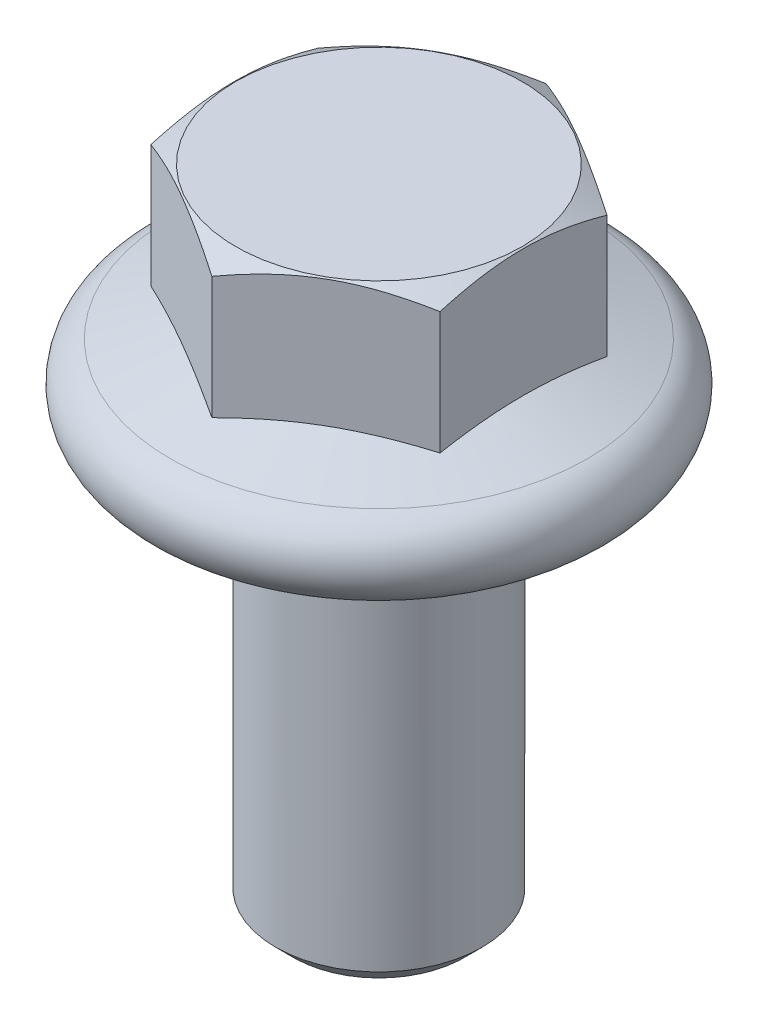
ISO-10303-21;
HEADER;
FILE_DESCRIPTION(('STEP AP214'),'2;1');
FILE_NAME('part.step','',(''),(''),'','','');
FILE_SCHEMA(('AUTOMOTIVE_DESIGN { 1 0 10303 214 1 1 1 1 }'));
ENDSEC;
DATA;
#1=APPLICATION_CONTEXT('core data for automotive mechanical design processes');
#2=APPLICATION_PROTOCOL_DEFINITION('international standard','automotive_design',2000,#1);
#3=PRODUCT_CONTEXT('',#1,'mechanical');
#4=PRODUCT('Part','Part','',(#3));
#5=PRODUCT_RELATED_PRODUCT_CATEGORY('part','',(#4));
#6=PRODUCT_DEFINITION_FORMATION('','',#4);
#7=PRODUCT_DEFINITION_CONTEXT('part definition',#1,'design');
#8=PRODUCT_DEFINITION('design','',#6,#7);
#9=PRODUCT_DEFINITION_SHAPE('','',#8);
#10=(LENGTH_UNIT() NAMED_UNIT(*) SI_UNIT(.MILLI.,.METRE.));
#11=(NAMED_UNIT(*) PLANE_ANGLE_UNIT() SI_UNIT($,.RADIAN.));
#12=(NAMED_UNIT(*) SI_UNIT($,.STERADIAN.) SOLID_ANGLE_UNIT());
#13=UNCERTAINTY_MEASURE_WITH_UNIT(LENGTH_MEASURE(1.E-05),#10,'distance_accuracy_value','');
#14=(GEOMETRIC_REPRESENTATION_CONTEXT(3) GLOBAL_UNCERTAINTY_ASSIGNED_CONTEXT((#13)) GLOBAL_UNIT_ASSIGNED_CONTEXT((#10,
#11,#12)) REPRESENTATION_CONTEXT('',''));
#15=CARTESIAN_POINT('',(0.,0.,0.));
#16=DIRECTION('',(0.,0.,1.));
#17=DIRECTION('',(1.,0.,0.));
#18=AXIS2_PLACEMENT_3D('',#15,#16,#17);
#19=CARTESIAN_POINT('',(240.373014836143,302.855724271466,22.6340957400018));
#20=DIRECTION('',(-0.5,0.,0.866025403784439));
#21=DIRECTION('',(-0.866025403784439,0.,-0.5));
#22=AXIS2_PLACEMENT_3D('',#19,#20,#21);
#23=PLANE('',#22);
#24=CARTESIAN_POINT('',(242.123014836143,301.859593955879,23.6444587110837));
#25=CARTESIAN_POINT('',(241.978072119349,301.890061991369,23.5607759945255));
#26=CARTESIAN_POINT('',(241.832651473807,301.917777838993,23.4768173456761));
#27=CARTESIAN_POINT('',(241.540864732313,301.966539457553,23.3083541919284));
#28=CARTESIAN_POINT('',(241.394497987511,301.987580010171,23.2238493124171));
#29=CARTESIAN_POINT('',(241.102443223051,302.021612455459,23.0552314155375));
#30=CARTESIAN_POINT('',(240.95676187187,302.034678571179,22.9711222482173));
#31=CARTESIAN_POINT('',(240.66505852699,302.052203892642,22.8027072435273));
#32=CARTESIAN_POINT('',(240.519036681566,302.056666325061,22.7184014917646));
#33=CARTESIAN_POINT('',(240.22699299072,302.056666325061,22.5497899882391));
#34=CARTESIAN_POINT('',(240.080971145296,302.052203892642,22.4654842364763));
#35=CARTESIAN_POINT('',(239.789267800416,302.034678571179,22.2970692317863));
#36=CARTESIAN_POINT('',(239.643586449235,302.021612455459,22.2129600644661));
#37=CARTESIAN_POINT('',(239.351531684774,301.987580010171,22.0443421675865));
#38=CARTESIAN_POINT('',(239.205164939973,301.966539457553,21.9598372880752));
#39=CARTESIAN_POINT('',(238.913378198479,301.917777838993,21.7913741343275));
#40=CARTESIAN_POINT('',(238.767957552937,301.890061991369,21.7074154854781));
#41=CARTESIAN_POINT('',(238.623014836143,301.859593955879,21.62373276892));
#42=B_SPLINE_CURVE_WITH_KNOTS('',3,(#24,#25,#26,#27,#28,#29,#30,#31,#32,#33,#34,#35,#36,#37,#38,
#39,#40,#41),.UNSPECIFIED.,.F.,.F.,(4,2,2,2,2,2,2,2,4),(0.,0.510400948319148,1.02119991788172,
1.52716902069207,2.03294833077719,2.53872764086231,3.04469674367264,3.55549571323521,
4.06589666155436),.UNSPECIFIED.);
#43=CARTESIAN_POINT('',(242.123014836143,301.859593955879,23.6444587110837));
#44=VERTEX_POINT('',#43);
#45=CARTESIAN_POINT('',(238.623014836143,301.859593955879,21.62373276892));
#46=VERTEX_POINT('',#45);
#47=EDGE_CURVE('E41',#44,#46,#42,.T.);
#48=ORIENTED_EDGE('',*,*,#47,.F.);
#49=DIRECTION('',(0.,1.,0.));
#50=VECTOR('',#49,1.);
#51=CARTESIAN_POINT('',(242.123014836143,300.555724271466,23.6444587110837));
#52=LINE('',#51,#50);
#53=CARTESIAN_POINT('',(242.123014836143,304.822909620874,23.6444587110837));
#54=VERTEX_POINT('',#53);
#55=EDGE_CURVE('E11',#44,#54,#52,.T.);
#56=ORIENTED_EDGE('',*,*,#55,.T.);
#57=CARTESIAN_POINT('',(242.123014836143,304.822909620874,23.6444587110836));
#58=CARTESIAN_POINT('',(241.969211032908,304.874192416903,23.5556600438833));
#59=CARTESIAN_POINT('',(241.814079597431,304.920831435949,23.466094867851));
#60=CARTESIAN_POINT('',(241.501130729442,305.002238442924,23.2854137546753));
#61=CARTESIAN_POINT('',(241.343307738245,305.036977635283,23.1942946082231));
#62=CARTESIAN_POINT('',(241.029617577065,305.091051692719,23.0131855092237));
#63=CARTESIAN_POINT('',(240.873798658814,305.11074649258,22.9232234148268));
#64=CARTESIAN_POINT('',(240.561428025334,305.134253576646,22.7428761455004));
#65=CARTESIAN_POINT('',(240.404877444709,305.13808533142,22.6524916256343));
#66=CARTESIAN_POINT('',(240.112379479151,305.130093613104,22.4836178464821));
#67=CARTESIAN_POINT('',(239.976388202516,305.120232371746,22.4051032463097));
#68=CARTESIAN_POINT('',(239.705291588055,305.088984344618,22.2485855429739));
#69=CARTESIAN_POINT('',(239.570187187179,305.06758689503,22.1705829807595));
#70=CARTESIAN_POINT('',(239.298532088125,305.014097412533,22.0137428361941));
#71=CARTESIAN_POINT('',(239.162015754222,304.981778746993,21.9349250940662));
#72=CARTESIAN_POINT('',(238.891018638634,304.908429039406,21.7784648364323));
#73=CARTESIAN_POINT('',(238.756534387842,304.867415220558,21.7008203180356));
#74=CARTESIAN_POINT('',(238.623014836143,304.822909620875,21.62373276892));
#75=B_SPLINE_CURVE_WITH_KNOTS('',3,(#57,#58,#59,#60,#61,#62,#63,#64,#65,#66,#67,#68,#69,#70,#71,
#72,#73,#74),.UNSPECIFIED.,.F.,.F.,(4,2,2,2,2,2,2,2,4),(0.,0.554778020224514,1.11088917979749,
1.65323831076767,2.19492155557127,2.66648861960586,3.13849233914022,3.62096283935513,
4.10248645365111),.UNSPECIFIED.);
#76=CARTESIAN_POINT('',(238.623014836143,304.822909620874,21.62373276892));
#77=VERTEX_POINT('',#76);
#78=EDGE_CURVE('E33',#54,#77,#75,.T.);
#79=ORIENTED_EDGE('',*,*,#78,.T.);
#80=DIRECTION('',(0.,1.,0.));
#81=VECTOR('',#80,1.);
#82=CARTESIAN_POINT('',(238.623014836143,300.555724271466,21.62373276892));
#83=LINE('',#82,#81);
#84=EDGE_CURVE('E148',#46,#77,#83,.T.);
#85=ORIENTED_EDGE('',*,*,#84,.F.);
#86=EDGE_LOOP('',(#48,#56,#79,#85));
#87=FACE_BOUND('',#86,.T.);
#88=ADVANCED_FACE('F17',(#87),#23,.T.);
#89=CARTESIAN_POINT('',(238.623014836143,302.855724271466,19.6030068267563));
#90=DIRECTION('',(-1.,0.,0.));
#91=DIRECTION('',(0.,0.,-1.));
#92=AXIS2_PLACEMENT_3D('',#89,#90,#91);
#93=PLANE('',#92);
#94=CARTESIAN_POINT('',(238.623014836143,301.859593955879,21.6237327689199));
#95=CARTESIAN_POINT('',(238.623014836143,301.890061991369,21.4563673358036));
#96=CARTESIAN_POINT('',(238.623014836143,301.917777838993,21.2884500381049));
#97=CARTESIAN_POINT('',(238.623014836143,301.966539457553,20.9515237306094));
#98=CARTESIAN_POINT('',(238.623014836143,301.987580010171,20.7825139715868));
#99=CARTESIAN_POINT('',(238.623014836143,302.021612455459,20.4452781778276));
#100=CARTESIAN_POINT('',(238.623014836143,302.034678571179,20.2770598431872));
#101=CARTESIAN_POINT('',(238.623014836143,302.052203892642,19.9402298338073));
#102=CARTESIAN_POINT('',(238.623014836143,302.056666325061,19.7716183302818));
#103=CARTESIAN_POINT('',(238.623014836143,302.056666325061,19.4343953232308));
#104=CARTESIAN_POINT('',(238.623014836143,302.052203892642,19.2657838197053));
#105=CARTESIAN_POINT('',(238.623014836143,302.034678571179,18.9289538103254));
#106=CARTESIAN_POINT('',(238.623014836143,302.021612455459,18.760735475685));
#107=CARTESIAN_POINT('',(238.623014836143,301.987580010171,18.4234996819258));
#108=CARTESIAN_POINT('',(238.623014836143,301.966539457553,18.2544899229032));
#109=CARTESIAN_POINT('',(238.623014836143,301.917777838993,17.9175636154077));
#110=CARTESIAN_POINT('',(238.623014836143,301.890061991369,17.749646317709));
#111=CARTESIAN_POINT('',(238.623014836143,301.859593955879,17.5822808845926));
#112=B_SPLINE_CURVE_WITH_KNOTS('',3,(#94,#95,#96,#97,#98,#99,#100,#101,#102,#103,#104,#105,#106,
#107,#108,#109,#110,#111),.UNSPECIFIED.,.F.,.F.,(4,2,2,2,2,2,2,2,4),(0.,0.51040094831915,
1.02119991788171,1.52716902069203,2.03294833077715,2.53872764086227,3.04469674367259,
3.55549571323515,4.0658966615543),.UNSPECIFIED.);
#113=CARTESIAN_POINT('',(238.623014836143,301.859593955879,17.5822808845926));
#114=VERTEX_POINT('',#113);
#115=EDGE_CURVE('E255',#46,#114,#112,.T.);
#116=ORIENTED_EDGE('',*,*,#115,.F.);
#117=ORIENTED_EDGE('',*,*,#84,.T.);
#118=CARTESIAN_POINT('',(238.623014836143,304.822909620874,21.6237327689202));
#119=CARTESIAN_POINT('',(238.623014836143,304.874192416903,21.4461354345196));
#120=CARTESIAN_POINT('',(238.623014836143,304.920831435949,21.267005082455));
#121=CARTESIAN_POINT('',(238.623014836143,305.002238442924,20.9056428561034));
#122=CARTESIAN_POINT('',(238.623014836143,305.036977635283,20.7234045631991));
#123=CARTESIAN_POINT('',(238.623014836143,305.091051692719,20.3611863652003));
#124=CARTESIAN_POINT('',(238.623014836143,305.11074649258,20.1812621764065));
#125=CARTESIAN_POINT('',(238.623014836143,305.134253576646,19.8205676377536));
#126=CARTESIAN_POINT('',(238.623014836143,305.13808533142,19.6397985980215));
#127=CARTESIAN_POINT('',(238.623014836143,305.130093613104,19.3020510397171));
#128=CARTESIAN_POINT('',(238.623014836143,305.120232371746,19.1450218393722));
#129=CARTESIAN_POINT('',(238.623014836143,305.088984344618,18.8319864327006));
#130=CARTESIAN_POINT('',(238.623014836143,305.06758689503,18.6759813082717));
#131=CARTESIAN_POINT('',(238.623014836143,305.014097412533,18.3623010191409));
#132=CARTESIAN_POINT('',(238.623014836143,304.981778746993,18.2046655348852));
#133=CARTESIAN_POINT('',(238.623014836143,304.908429039406,17.8917450196172));
#134=CARTESIAN_POINT('',(238.623014836143,304.867415220558,17.7364559828239));
#135=CARTESIAN_POINT('',(238.623014836143,304.822909620874,17.5822808845927));
#136=B_SPLINE_CURVE_WITH_KNOTS('',3,(#118,#119,#120,#121,#122,#123,#124,#125,#126,#127,#128,
#129,#130,#131,#132,#133,#134,#135),.UNSPECIFIED.,.F.,.F.,(4,2,2,2,2,2,2,2,4),(0.,
0.554778020224538,1.11088917979755,1.65323831076773,2.1949215555713,2.66648861960593,
3.13849233914035,3.62096283935536,4.1024864536514),.UNSPECIFIED.);
#137=CARTESIAN_POINT('',(238.623014836143,304.822909620874,17.5822808845926));
#138=VERTEX_POINT('',#137);
#139=EDGE_CURVE('E150',#77,#138,#136,.T.);
#140=ORIENTED_EDGE('',*,*,#139,.T.);
#141=DIRECTION('',(0.,1.,0.));
#142=VECTOR('',#141,1.);
#143=CARTESIAN_POINT('',(238.623014836143,300.555724271466,17.5822808845926));
#144=LINE('',#143,#142);
#145=EDGE_CURVE('E159',#114,#138,#144,.T.);
#146=ORIENTED_EDGE('',*,*,#145,.F.);
#147=EDGE_LOOP('',(#116,#117,#140,#146));
#148=FACE_BOUND('',#147,.T.);
#149=ADVANCED_FACE('F260',(#148),#93,.T.);
#150=CARTESIAN_POINT('',(240.373014836143,302.855724271466,16.5719179135108));
#151=DIRECTION('',(-0.5,0.,-0.866025403784439));
#152=DIRECTION('',(0.866025403784439,0.,-0.5));
#153=AXIS2_PLACEMENT_3D('',#150,#151,#152);
#154=PLANE('',#153);
#155=CARTESIAN_POINT('',(238.623014836143,301.859593955879,17.5822808845926));
#156=CARTESIAN_POINT('',(238.767957552937,301.890061991369,17.4985981680345));
#157=CARTESIAN_POINT('',(238.913378198479,301.917777838993,17.4146395191851));
#158=CARTESIAN_POINT('',(239.205164939973,301.966539457553,17.2461763654374));
#159=CARTESIAN_POINT('',(239.351531684774,301.987580010171,17.1616714859261));
#160=CARTESIAN_POINT('',(239.643586449235,302.021612455459,16.9930535890465));
#161=CARTESIAN_POINT('',(239.789267800416,302.034678571179,16.9089444217263));
#162=CARTESIAN_POINT('',(240.080971145296,302.052203892642,16.7405294170363));
#163=CARTESIAN_POINT('',(240.22699299072,302.056666325061,16.6562236652736));
#164=CARTESIAN_POINT('',(240.519036681566,302.056666325061,16.487612161748));
#165=CARTESIAN_POINT('',(240.66505852699,302.052203892642,16.4033064099853));
#166=CARTESIAN_POINT('',(240.95676187187,302.034678571179,16.2348914052953));
#167=CARTESIAN_POINT('',(241.102443223051,302.021612455459,16.1507822379751));
#168=CARTESIAN_POINT('',(241.394497987511,301.987580010171,15.9821643410955));
#169=CARTESIAN_POINT('',(241.540864732313,301.966539457553,15.8976594615842));
#170=CARTESIAN_POINT('',(241.832651473807,301.917777838993,15.7291963078365));
#171=CARTESIAN_POINT('',(241.978072119349,301.890061991369,15.6452376589871));
#172=CARTESIAN_POINT('',(242.123014836143,301.859593955879,15.5615549424289));
#173=B_SPLINE_CURVE_WITH_KNOTS('',3,(#155,#156,#157,#158,#159,#160,#161,#162,#163,#164,#165,
#166,#167,#168,#169,#170,#171,#172),.UNSPECIFIED.,.F.,.F.,(4,2,2,2,2,2,2,2,4),(0.,
0.510400948319151,1.02119991788172,1.52716902069205,2.03294833077717,2.53872764086229,
3.04469674367264,3.55549571323521,4.06589666155436),.UNSPECIFIED.);
#174=CARTESIAN_POINT('',(242.123014836143,301.859593955879,15.5615549424289));
#175=VERTEX_POINT('',#174);
#176=EDGE_CURVE('E228',#114,#175,#173,.T.);
#177=ORIENTED_EDGE('',*,*,#176,.F.);
#178=ORIENTED_EDGE('',*,*,#145,.T.);
#179=CARTESIAN_POINT('',(238.623014836143,304.822909620874,17.5822808845926));
#180=CARTESIAN_POINT('',(238.776818639378,304.874192416903,17.4934822173923));
#181=CARTESIAN_POINT('',(238.931950074855,304.920831435949,17.40391704136));
#182=CARTESIAN_POINT('',(239.244898942844,305.002238442924,17.2232359281843));
#183=CARTESIAN_POINT('',(239.402721934041,305.036977635283,17.1321167817321));
#184=CARTESIAN_POINT('',(239.716412095221,305.091051692719,16.9510076827327));
#185=CARTESIAN_POINT('',(239.872231013472,305.11074649258,16.8610455883358));
#186=CARTESIAN_POINT('',(240.184601646952,305.134253576646,16.6806983190094));
#187=CARTESIAN_POINT('',(240.341152227577,305.13808533142,16.5903137991433));
#188=CARTESIAN_POINT('',(240.633650193135,305.130093613104,16.4214400199911));
#189=CARTESIAN_POINT('',(240.76964146977,305.120232371746,16.3429254198186));
#190=CARTESIAN_POINT('',(241.040738084231,305.088984344618,16.1864077164829));
#191=CARTESIAN_POINT('',(241.175842485107,305.06758689503,16.1084051542684));
#192=CARTESIAN_POINT('',(241.447497584161,305.014097412533,15.951565009703));
#193=CARTESIAN_POINT('',(241.584013918064,304.981778746993,15.8727472675752));
#194=CARTESIAN_POINT('',(241.855011033652,304.908429039406,15.7162870099412));
#195=CARTESIAN_POINT('',(241.989495284444,304.867415220558,15.6386424915446));
#196=CARTESIAN_POINT('',(242.123014836143,304.822909620874,15.561554942429));
#197=B_SPLINE_CURVE_WITH_KNOTS('',3,(#179,#180,#181,#182,#183,#184,#185,#186,#187,#188,#189,
#190,#191,#192,#193,#194,#195,#196),.UNSPECIFIED.,.F.,.F.,(4,2,2,2,2,2,2,2,4),(0.,
0.554778020224544,1.11088917979755,1.65323831076773,2.19492155557129,2.66648861960589,
3.13849233914025,3.62096283935524,4.10248645365126),.UNSPECIFIED.);
#198=CARTESIAN_POINT('',(242.123014836143,304.822909620874,15.5615549424289));
#199=VERTEX_POINT('',#198);
#200=EDGE_CURVE('E158',#138,#199,#197,.T.);
#201=ORIENTED_EDGE('',*,*,#200,.T.);
#202=DIRECTION('',(0.,1.,0.));
#203=VECTOR('',#202,1.);
#204=CARTESIAN_POINT('',(242.123014836143,300.555724271466,15.5615549424289));
#205=LINE('',#204,#203);
#206=EDGE_CURVE('E156',#175,#199,#205,.T.);
#207=ORIENTED_EDGE('',*,*,#206,.F.);
#208=EDGE_LOOP('',(#177,#178,#201,#207));
#209=FACE_BOUND('',#208,.T.);
#210=ADVANCED_FACE('F219',(#209),#154,.T.);
#211=CARTESIAN_POINT('',(243.873014836143,302.855724271466,16.5719179135108));
#212=DIRECTION('',(0.5,0.,-0.866025403784439));
#213=DIRECTION('',(0.866025403784439,0.,0.5));
#214=AXIS2_PLACEMENT_3D('',#211,#212,#213);
#215=PLANE('',#214);
#216=CARTESIAN_POINT('',(242.123014836143,301.859593955879,15.5615549424289));
#217=CARTESIAN_POINT('',(242.267957552937,301.890061991369,15.6452376589871));
#218=CARTESIAN_POINT('',(242.413378198479,301.917777838993,15.7291963078365));
#219=CARTESIAN_POINT('',(242.705164939973,301.966539457553,15.8976594615842));
#220=CARTESIAN_POINT('',(242.851531684774,301.987580010171,15.9821643410955));
#221=CARTESIAN_POINT('',(243.143586449235,302.021612455459,16.1507822379751));
#222=CARTESIAN_POINT('',(243.289267800416,302.034678571179,16.2348914052953));
#223=CARTESIAN_POINT('',(243.580971145296,302.052203892642,16.4033064099853));
#224=CARTESIAN_POINT('',(243.72699299072,302.056666325061,16.487612161748));
#225=CARTESIAN_POINT('',(244.019036681566,302.056666325061,16.6562236652736));
#226=CARTESIAN_POINT('',(244.16505852699,302.052203892642,16.7405294170363));
#227=CARTESIAN_POINT('',(244.45676187187,302.034678571179,16.9089444217263));
#228=CARTESIAN_POINT('',(244.602443223051,302.021612455459,16.9930535890465));
#229=CARTESIAN_POINT('',(244.894497987511,301.987580010171,17.1616714859261));
#230=CARTESIAN_POINT('',(245.040864732313,301.966539457553,17.2461763654374));
#231=CARTESIAN_POINT('',(245.332651473807,301.917777838993,17.4146395191851));
#232=CARTESIAN_POINT('',(245.478072119349,301.890061991369,17.4985981680345));
#233=CARTESIAN_POINT('',(245.623014836143,301.859593955879,17.5822808845926));
#234=B_SPLINE_CURVE_WITH_KNOTS('',3,(#216,#217,#218,#219,#220,#221,#222,#223,#224,#225,#226,
#227,#228,#229,#230,#231,#232,#233),.UNSPECIFIED.,.F.,.F.,(4,2,2,2,2,2,2,2,4),(0.,
0.510400948319148,1.02119991788172,1.52716902069207,2.03294833077719,2.53872764086231,
3.04469674367264,3.55549571323521,4.06589666155436),.UNSPECIFIED.);
#235=CARTESIAN_POINT('',(245.623014836143,301.859593955879,17.5822808845926));
#236=VERTEX_POINT('',#235);
#237=EDGE_CURVE('E64',#175,#236,#234,.T.);
#238=ORIENTED_EDGE('',*,*,#237,.F.);
#239=ORIENTED_EDGE('',*,*,#206,.T.);
#240=CARTESIAN_POINT('',(242.123014836143,304.822909620874,15.561554942429));
#241=CARTESIAN_POINT('',(242.276818639378,304.874192416903,15.6503536096293));
#242=CARTESIAN_POINT('',(242.431950074855,304.920831435949,15.7399187856616));
#243=CARTESIAN_POINT('',(242.744898942844,305.002238442924,15.9205998988373));
#244=CARTESIAN_POINT('',(242.902721934041,305.036977635283,16.0117190452895));
#245=CARTESIAN_POINT('',(243.216412095221,305.091051692719,16.1928281442889));
#246=CARTESIAN_POINT('',(243.372231013472,305.11074649258,16.2827902386858));
#247=CARTESIAN_POINT('',(243.684601646952,305.134253576646,16.4631375080122));
#248=CARTESIAN_POINT('',(243.841152227577,305.13808533142,16.5535220278783));
#249=CARTESIAN_POINT('',(244.133650193135,305.130093613104,16.7223958070305));
#250=CARTESIAN_POINT('',(244.26964146977,305.120232371746,16.800910407203));
#251=CARTESIAN_POINT('',(244.540738084231,305.088984344618,16.9574281105387));
#252=CARTESIAN_POINT('',(244.675842485107,305.06758689503,17.0354306727532));
#253=CARTESIAN_POINT('',(244.947497584161,305.014097412533,17.1922708173186));
#254=CARTESIAN_POINT('',(245.084013918064,304.981778746993,17.2710885594464));
#255=CARTESIAN_POINT('',(245.355011033652,304.908429039406,17.4275488170804));
#256=CARTESIAN_POINT('',(245.489495284444,304.867415220558,17.505193335477));
#257=CARTESIAN_POINT('',(245.623014836143,304.822909620874,17.5822808845926));
#258=B_SPLINE_CURVE_WITH_KNOTS('',3,(#240,#241,#242,#243,#244,#245,#246,#247,#248,#249,#250,
#251,#252,#253,#254,#255,#256,#257),.UNSPECIFIED.,.F.,.F.,(4,2,2,2,2,2,2,2,4),(0.,
0.554778020224515,1.11088917979755,1.65323831076773,2.19492155557129,2.66648861960589,
3.13849233914025,3.62096283935524,4.10248645365126),.UNSPECIFIED.);
#259=CARTESIAN_POINT('',(245.623014836143,304.822909620874,17.5822808845926));
#260=VERTEX_POINT('',#259);
#261=EDGE_CURVE('E155',#199,#260,#258,.T.);
#262=ORIENTED_EDGE('',*,*,#261,.T.);
#263=DIRECTION('',(0.,1.,0.));
#264=VECTOR('',#263,1.);
#265=CARTESIAN_POINT('',(245.623014836143,300.555724271466,17.5822808845926));
#266=LINE('',#265,#264);
#267=EDGE_CURVE('E153',#236,#260,#266,.T.);
#268=ORIENTED_EDGE('',*,*,#267,.F.);
#269=EDGE_LOOP('',(#238,#239,#262,#268));
#270=FACE_BOUND('',#269,.T.);
#271=ADVANCED_FACE('F214',(#270),#215,.T.);
#272=CARTESIAN_POINT('',(245.623014836143,302.855724271466,19.6030068267563));
#273=DIRECTION('',(1.,0.,0.));
#274=DIRECTION('',(0.,0.,1.));
#275=AXIS2_PLACEMENT_3D('',#272,#273,#274);
#276=PLANE('',#275);
#277=CARTESIAN_POINT('',(245.623014836143,301.859593955879,17.5822808845926));
#278=CARTESIAN_POINT('',(245.623014836143,301.890061991369,17.749646317709));
#279=CARTESIAN_POINT('',(245.623014836143,301.917777838993,17.9175636154077));
#280=CARTESIAN_POINT('',(245.623014836143,301.966539457553,18.2544899229032));
#281=CARTESIAN_POINT('',(245.623014836143,301.987580010171,18.4234996819258));
#282=CARTESIAN_POINT('',(245.623014836143,302.021612455459,18.760735475685));
#283=CARTESIAN_POINT('',(245.623014836143,302.034678571179,18.9289538103254));
#284=CARTESIAN_POINT('',(245.623014836143,302.052203892642,19.2657838197053));
#285=CARTESIAN_POINT('',(245.623014836143,302.056666325061,19.4343953232308));
#286=CARTESIAN_POINT('',(245.623014836143,302.056666325061,19.7716183302818));
#287=CARTESIAN_POINT('',(245.623014836143,302.052203892642,19.9402298338073));
#288=CARTESIAN_POINT('',(245.623014836143,302.034678571179,20.2770598431872));
#289=CARTESIAN_POINT('',(245.623014836143,302.021612455459,20.4452781778276));
#290=CARTESIAN_POINT('',(245.623014836143,301.987580010171,20.7825139715868));
#291=CARTESIAN_POINT('',(245.623014836143,301.966539457553,20.9515237306094));
#292=CARTESIAN_POINT('',(245.623014836143,301.917777838993,21.2884500381049));
#293=CARTESIAN_POINT('',(245.623014836143,301.890061991369,21.4563673358036));
#294=CARTESIAN_POINT('',(245.623014836143,301.859593955879,21.6237327689199));
#295=B_SPLINE_CURVE_WITH_KNOTS('',3,(#277,#278,#279,#280,#281,#282,#283,#284,#285,#286,#287,
#288,#289,#290,#291,#292,#293,#294),.UNSPECIFIED.,.F.,.F.,(4,2,2,2,2,2,2,2,4),(0.,
0.51040094831915,1.02119991788171,1.52716902069203,2.03294833077715,2.53872764086227,
3.04469674367259,3.55549571323515,4.0658966615543),.UNSPECIFIED.);
#296=CARTESIAN_POINT('',(245.623014836143,301.859593955879,21.62373276892));
#297=VERTEX_POINT('',#296);
#298=EDGE_CURVE('E21',#236,#297,#295,.T.);
#299=ORIENTED_EDGE('',*,*,#298,.F.);
#300=ORIENTED_EDGE('',*,*,#267,.T.);
#301=CARTESIAN_POINT('',(245.623014836143,304.822909620874,17.5822808845927));
#302=CARTESIAN_POINT('',(245.623014836143,304.874192416903,17.7598782189933));
#303=CARTESIAN_POINT('',(245.623014836143,304.920831435949,17.9390085710579));
#304=CARTESIAN_POINT('',(245.623014836143,305.002238442924,18.3003707974094));
#305=CARTESIAN_POINT('',(245.623014836143,305.036977635283,18.4826090903138));
#306=CARTESIAN_POINT('',(245.623014836143,305.091051692719,18.8448272883125));
#307=CARTESIAN_POINT('',(245.623014836143,305.11074649258,19.0247514771063));
#308=CARTESIAN_POINT('',(245.623014836143,305.134253576647,19.3854460157592));
#309=CARTESIAN_POINT('',(245.623014836143,305.13808533142,19.5662150554913));
#310=CARTESIAN_POINT('',(245.623014836143,305.130093613104,19.9039626137957));
#311=CARTESIAN_POINT('',(245.623014836143,305.120232371746,20.0609918141406));
#312=CARTESIAN_POINT('',(245.623014836143,305.088984344618,20.3740272208121));
#313=CARTESIAN_POINT('',(245.623014836143,305.06758689503,20.530032345241));
#314=CARTESIAN_POINT('',(245.623014836143,305.014097412533,20.8437126343718));
#315=CARTESIAN_POINT('',(245.623014836143,304.981778746993,21.0013481186275));
#316=CARTESIAN_POINT('',(245.623014836143,304.908429039406,21.3142686338954));
#317=CARTESIAN_POINT('',(245.623014836143,304.867415220558,21.4695576706887));
#318=CARTESIAN_POINT('',(245.623014836143,304.822909620874,21.6237327689199));
#319=B_SPLINE_CURVE_WITH_KNOTS('',3,(#301,#302,#303,#304,#305,#306,#307,#308,#309,#310,#311,
#312,#313,#314,#315,#316,#317,#318),.UNSPECIFIED.,.F.,.F.,(4,2,2,2,2,2,2,2,4),(0.,
0.554778020224512,1.1108891797975,1.65323831076766,2.19492155557121,2.66648861960579,
3.13849233914015,3.62096283935512,4.10248645365111),.UNSPECIFIED.);
#320=CARTESIAN_POINT('',(245.623014836143,304.822909620874,21.6237327689199));
#321=VERTEX_POINT('',#320);
#322=EDGE_CURVE('E152',#260,#321,#319,.T.);
#323=ORIENTED_EDGE('',*,*,#322,.T.);
#324=DIRECTION('',(0.,1.,0.));
#325=VECTOR('',#324,1.);
#326=CARTESIAN_POINT('',(245.623014836143,300.555724271466,21.62373276892));
#327=LINE('',#326,#325);
#328=EDGE_CURVE('E73',#297,#321,#327,.T.);
#329=ORIENTED_EDGE('',*,*,#328,.F.);
#330=EDGE_LOOP('',(#299,#300,#323,#329));
#331=FACE_BOUND('',#330,.T.);
#332=ADVANCED_FACE('F211',(#331),#276,.T.);
#333=CARTESIAN_POINT('',(243.873014836143,302.855724271466,22.6340957400018));
#334=DIRECTION('',(0.5,0.,0.866025403784439));
#335=DIRECTION('',(-0.866025403784439,0.,0.5));
#336=AXIS2_PLACEMENT_3D('',#333,#334,#335);
#337=PLANE('',#336);
#338=CARTESIAN_POINT('',(245.623014836143,301.859593955879,21.62373276892));
#339=CARTESIAN_POINT('',(245.478072119349,301.890061991369,21.7074154854781));
#340=CARTESIAN_POINT('',(245.332651473807,301.917777838993,21.7913741343275));
#341=CARTESIAN_POINT('',(245.040864732313,301.966539457553,21.9598372880752));
#342=CARTESIAN_POINT('',(244.894497987511,301.987580010171,22.0443421675865));
#343=CARTESIAN_POINT('',(244.602443223051,302.021612455459,22.2129600644661));
#344=CARTESIAN_POINT('',(244.45676187187,302.034678571179,22.2970692317863));
#345=CARTESIAN_POINT('',(244.16505852699,302.052203892642,22.4654842364763));
#346=CARTESIAN_POINT('',(244.019036681566,302.056666325061,22.5497899882391));
#347=CARTESIAN_POINT('',(243.72699299072,302.056666325061,22.7184014917646));
#348=CARTESIAN_POINT('',(243.580971145296,302.052203892642,22.8027072435273));
#349=CARTESIAN_POINT('',(243.289267800416,302.034678571179,22.9711222482173));
#350=CARTESIAN_POINT('',(243.143586449235,302.021612455459,23.0552314155375));
#351=CARTESIAN_POINT('',(242.851531684774,301.987580010171,23.2238493124171));
#352=CARTESIAN_POINT('',(242.705164939973,301.966539457553,23.3083541919284));
#353=CARTESIAN_POINT('',(242.413378198479,301.917777838993,23.4768173456761));
#354=CARTESIAN_POINT('',(242.267957552937,301.890061991369,23.5607759945255));
#355=CARTESIAN_POINT('',(242.123014836143,301.859593955879,23.6444587110837));
#356=B_SPLINE_CURVE_WITH_KNOTS('',3,(#338,#339,#340,#341,#342,#343,#344,#345,#346,#347,#348,
#349,#350,#351,#352,#353,#354,#355),.UNSPECIFIED.,.F.,.F.,(4,2,2,2,2,2,2,2,4),(0.,
0.510400948319151,1.02119991788172,1.52716902069205,2.03294833077717,2.53872764086229,
3.04469674367264,3.55549571323521,4.06589666155436),.UNSPECIFIED.);
#357=EDGE_CURVE('E121',#297,#44,#356,.T.);
#358=ORIENTED_EDGE('',*,*,#357,.F.);
#359=ORIENTED_EDGE('',*,*,#328,.T.);
#360=CARTESIAN_POINT('',(245.623014836143,304.822909620874,21.62373276892));
#361=CARTESIAN_POINT('',(245.469211032908,304.874192416903,21.7125314361203));
#362=CARTESIAN_POINT('',(245.314079597431,304.920831435949,21.8020966121526));
#363=CARTESIAN_POINT('',(245.001130729442,305.002238442924,21.9827777253283));
#364=CARTESIAN_POINT('',(244.843307738245,305.036977635283,22.0738968717805));
#365=CARTESIAN_POINT('',(244.529617577065,305.091051692719,22.2550059707799));
#366=CARTESIAN_POINT('',(244.373798658814,305.11074649258,22.3449680651768));
#367=CARTESIAN_POINT('',(244.061428025334,305.134253576646,22.5253153345032));
#368=CARTESIAN_POINT('',(243.904877444709,305.13808533142,22.6156998543693));
#369=CARTESIAN_POINT('',(243.612379479151,305.130093613104,22.7845736335215));
#370=CARTESIAN_POINT('',(243.476388202516,305.120232371746,22.8630882336939));
#371=CARTESIAN_POINT('',(243.205291588055,305.088984344618,23.0196059370297));
#372=CARTESIAN_POINT('',(243.070187187179,305.06758689503,23.0976084992441));
#373=CARTESIAN_POINT('',(242.798532088125,305.014097412533,23.2544486438096));
#374=CARTESIAN_POINT('',(242.662015754222,304.981778746993,23.3332663859374));
#375=CARTESIAN_POINT('',(242.391018638634,304.908429039406,23.4897266435714));
#376=CARTESIAN_POINT('',(242.256534387842,304.867415220558,23.567371161968));
#377=CARTESIAN_POINT('',(242.123014836143,304.822909620874,23.6444587110836));
#378=B_SPLINE_CURVE_WITH_KNOTS('',3,(#360,#361,#362,#363,#364,#365,#366,#367,#368,#369,#370,
#371,#372,#373,#374,#375,#376,#377),.UNSPECIFIED.,.F.,.F.,(4,2,2,2,2,2,2,2,4),(0.,
0.554778020224514,1.11088917979755,1.6532383107677,2.19492155557127,2.66648861960586,
3.13849233914025,3.62096283935524,4.10248645365126),.UNSPECIFIED.);
#379=EDGE_CURVE('E116',#321,#54,#378,.T.);
#380=ORIENTED_EDGE('',*,*,#379,.T.);
#381=ORIENTED_EDGE('',*,*,#55,.F.);
#382=EDGE_LOOP('',(#358,#359,#380,#381));
#383=FACE_BOUND('',#382,.T.);
#384=ADVANCED_FACE('F181',(#383),#337,.T.);
#385=CARTESIAN_POINT('',(242.123014836143,307.156242954208,19.6030068267563));
#386=DIRECTION('',(0.,-1.,0.));
#387=DIRECTION('',(1.,0.,0.));
#388=AXIS2_PLACEMENT_3D('',#385,#386,#387);
#389=CONICAL_SURFACE('',#388,0.,1.0471975511966);
#390=ORIENTED_EDGE('',*,*,#78,.F.);
#391=ORIENTED_EDGE('',*,*,#379,.F.);
#392=ORIENTED_EDGE('',*,*,#322,.F.);
#393=ORIENTED_EDGE('',*,*,#261,.F.);
#394=ORIENTED_EDGE('',*,*,#200,.F.);
#395=ORIENTED_EDGE('',*,*,#139,.F.);
#396=EDGE_LOOP('',(#390,#391,#392,#393,#394,#395));
#397=FACE_BOUND('',#396,.T.);
#398=CARTESIAN_POINT('',(242.123014836143,305.155724271466,19.6030068267563));
#399=DIRECTION('',(0.,1.,0.));
#400=DIRECTION('',(1.,0.,0.));
#401=AXIS2_PLACEMENT_3D('',#398,#399,#400);
#402=CIRCLE('',#401,3.465);
#403=CARTESIAN_POINT('',(245.588014836143,305.155724271466,19.6030068267563));
#404=VERTEX_POINT('',#403);
#405=EDGE_CURVE('E113',#404,#404,#402,.T.);
#406=ORIENTED_EDGE('',*,*,#405,.F.);
#407=EDGE_LOOP('',(#406));
#408=FACE_BOUND('',#407,.T.);
#409=ADVANCED_FACE('F114',(#397,#408),#389,.T.);
#410=CARTESIAN_POINT('',(242.123014836143,305.155724271466,19.6030068267563));
#411=DIRECTION('',(0.,1.,0.));
#412=DIRECTION('',(-1.,0.,0.));
#413=AXIS2_PLACEMENT_3D('',#410,#411,#412);
#414=PLANE('',#413);
#415=ORIENTED_EDGE('',*,*,#405,.T.);
#416=EDGE_LOOP('',(#415));
#417=FACE_BOUND('',#416,.T.);
#418=ADVANCED_FACE('F180',(#417),#414,.T.);
#419=CARTESIAN_POINT('',(242.123014836143,299.555724271466,19.6030068267563));
#420=DIRECTION('',(0.,-1.,0.));
#421=DIRECTION('',(1.,0.,0.));
#422=AXIS2_PLACEMENT_3D('',#419,#420,#421);
#423=PLANE('',#422);
#424=CARTESIAN_POINT('',(242.123014836143,299.555724271466,19.6030068267563));
#425=DIRECTION('',(0.,-1.,0.));
#426=DIRECTION('',(-1.,0.,0.));
#427=AXIS2_PLACEMENT_3D('',#424,#425,#426);
#428=CIRCLE('',#427,3.05551918177834);
#429=CARTESIAN_POINT('',(239.067495654365,299.555724271466,19.6030068267563));
#430=VERTEX_POINT('',#429);
#431=EDGE_CURVE('E124',#430,#430,#428,.T.);
#432=ORIENTED_EDGE('',*,*,#431,.F.);
#433=EDGE_LOOP('',(#432));
#434=FACE_BOUND('',#433,.T.);
#435=CARTESIAN_POINT('',(242.123014836143,299.555724271466,19.6030068267563));
#436=DIRECTION('',(0.,-1.,0.));
#437=DIRECTION('',(-1.,0.,0.));
#438=AXIS2_PLACEMENT_3D('',#435,#436,#437);
#439=CIRCLE('',#438,4.7);
#440=CARTESIAN_POINT('',(237.423014836143,299.555724271466,19.6030068267563));
#441=VERTEX_POINT('',#440);
#442=EDGE_CURVE('E117',#441,#441,#439,.T.);
#443=ORIENTED_EDGE('',*,*,#442,.T.);
#444=EDGE_LOOP('',(#443));
#445=FACE_BOUND('',#444,.T.);
#446=ADVANCED_FACE('F239',(#434,#445),#423,.T.);
#447=CARTESIAN_POINT('',(242.123014836143,302.355724271466,19.6030068267563));
#448=DIRECTION('',(0.,-1.,0.));
#449=DIRECTION('',(1.,0.,0.));
#450=AXIS2_PLACEMENT_3D('',#447,#448,#449);
#451=CONICAL_SURFACE('',#450,2.67834504514476,1.22173047639603);
#452=ORIENTED_EDGE('',*,*,#357,.T.);
#453=ORIENTED_EDGE('',*,*,#47,.T.);
#454=ORIENTED_EDGE('',*,*,#115,.T.);
#455=ORIENTED_EDGE('',*,*,#176,.T.);
#456=ORIENTED_EDGE('',*,*,#237,.T.);
#457=ORIENTED_EDGE('',*,*,#298,.T.);
#458=EDGE_LOOP('',(#452,#453,#454,#455,#456,#457));
#459=FACE_BOUND('',#458,.T.);
#460=CARTESIAN_POINT('',(242.123014836143,301.495416892252,19.6030068267563));
#461=DIRECTION('',(0.,1.,0.));
#462=DIRECTION('',(1.,0.,0.));
#463=AXIS2_PLACEMENT_3D('',#460,#461,#462);
#464=CIRCLE('',#463,5.04202014332566);
#465=CARTESIAN_POINT('',(247.165034979469,301.495416892252,19.6030068267563));
#466=VERTEX_POINT('',#465);
#467=EDGE_CURVE('E129',#466,#466,#464,.T.);
#468=ORIENTED_EDGE('',*,*,#467,.T.);
#469=EDGE_LOOP('',(#468));
#470=FACE_BOUND('',#469,.T.);
#471=ADVANCED_FACE('F234',(#459,#470),#451,.T.);
#472=CARTESIAN_POINT('',(242.123014836143,300.555724271466,19.6030068267563));
#473=DIRECTION('',(0.,-1.,0.));
#474=DIRECTION('',(1.,0.,0.));
#475=AXIS2_PLACEMENT_3D('',#472,#473,#474);
#476=TOROIDAL_SURFACE('',#475,4.7,1.);
#477=ORIENTED_EDGE('',*,*,#442,.F.);
#478=EDGE_LOOP('',(#477));
#479=FACE_BOUND('',#478,.T.);
#480=ORIENTED_EDGE('',*,*,#467,.F.);
#481=EDGE_LOOP('',(#480));
#482=FACE_BOUND('',#481,.T.);
#483=ADVANCED_FACE('F238',(#479,#482),#476,.T.);
#484=CARTESIAN_POINT('',(242.123014836143,299.605724271466,19.6030068267563));
#485=DIRECTION('',(0.,-1.,0.));
#486=DIRECTION('',(1.,0.,0.));
#487=AXIS2_PLACEMENT_3D('',#484,#485,#486);
#488=TOROIDAL_SURFACE('',#487,2.86187001446222,0.1);
#489=CARTESIAN_POINT('',(242.123014836143,299.625186155325,19.6030068267563));
#490=DIRECTION('',(0.,1.,0.));
#491=DIRECTION('',(-1.,0.,0.));
#492=AXIS2_PLACEMENT_3D('',#489,#490,#491);
#493=CIRCLE('',#492,2.76378211981328);
#494=CARTESIAN_POINT('',(239.35923271633,299.625186155325,19.6030068267563));
#495=VERTEX_POINT('',#494);
#496=EDGE_CURVE('E126',#495,#495,#493,.T.);
#497=ORIENTED_EDGE('',*,*,#496,.T.);
#498=EDGE_LOOP('',(#497));
#499=FACE_BOUND('',#498,.T.);
#500=CARTESIAN_POINT('',(242.123014836143,299.630724271467,19.6030068267563));
#501=DIRECTION('',(0.,1.,0.));
#502=DIRECTION('',(-1.,0.,0.));
#503=AXIS2_PLACEMENT_3D('',#500,#501,#502);
#504=CIRCLE('',#503,2.95869459812297);
#505=CARTESIAN_POINT('',(239.16432023802,299.630724271467,19.6030068267563));
#506=VERTEX_POINT('',#505);
#507=EDGE_CURVE('E127',#506,#506,#504,.T.);
#508=ORIENTED_EDGE('',*,*,#507,.F.);
#509=EDGE_LOOP('',(#508));
#510=FACE_BOUND('',#509,.T.);
#511=ADVANCED_FACE('F318',(#499,#510),#488,.F.);
#512=CARTESIAN_POINT('',(242.123014836143,299.655724271466,19.6030068267563));
#513=DIRECTION('',(0.,-1.,0.));
#514=DIRECTION('',(1.,0.,0.));
#515=AXIS2_PLACEMENT_3D('',#512,#513,#514);
#516=TOROIDAL_SURFACE('',#515,3.05551918177834,0.1);
#517=ORIENTED_EDGE('',*,*,#431,.T.);
#518=EDGE_LOOP('',(#517));
#519=FACE_BOUND('',#518,.T.);
#520=ORIENTED_EDGE('',*,*,#507,.T.);
#521=EDGE_LOOP('',(#520));
#522=FACE_BOUND('',#521,.T.);
#523=ADVANCED_FACE('F325',(#519,#522),#516,.T.);
#524=CARTESIAN_POINT('',(242.123014836143,289.555724271466,19.6030068267563));
#525=DIRECTION('',(0.,-1.,0.));
#526=DIRECTION('',(1.,0.,0.));
#527=AXIS2_PLACEMENT_3D('',#524,#525,#526);
#528=PLANE('',#527);
#529=CARTESIAN_POINT('',(242.123014836143,289.555724271466,19.6030068267563));
#530=DIRECTION('',(0.,-1.,0.));
#531=DIRECTION('',(-1.,0.,0.));
#532=AXIS2_PLACEMENT_3D('',#529,#530,#531);
#533=CIRCLE('',#532,2.0669872984);
#534=CARTESIAN_POINT('',(240.056027537743,289.555724271466,19.6030068267563));
#535=VERTEX_POINT('',#534);
#536=EDGE_CURVE('E136',#535,#535,#533,.T.);
#537=ORIENTED_EDGE('',*,*,#536,.T.);
#538=EDGE_LOOP('',(#537));
#539=FACE_BOUND('',#538,.T.);
#540=ADVANCED_FACE('F332',(#539),#528,.T.);
#541=CARTESIAN_POINT('',(242.123014836143,298.295724271466,19.6030068267563));
#542=DIRECTION('',(0.,-1.,0.));
#543=DIRECTION('',(1.,0.,0.));
#544=AXIS2_PLACEMENT_3D('',#541,#542,#543);
#545=CYLINDRICAL_SURFACE('',#544,2.5);
#546=CARTESIAN_POINT('',(242.123014836143,289.988736973066,19.6030068267563));
#547=DIRECTION('',(0.,1.,0.));
#548=DIRECTION('',(-1.,0.,0.));
#549=AXIS2_PLACEMENT_3D('',#546,#547,#548);
#550=CIRCLE('',#549,2.5);
#551=CARTESIAN_POINT('',(239.623014836143,289.988736973066,19.6030068267563));
#552=VERTEX_POINT('',#551);
#553=EDGE_CURVE('E139',#552,#552,#550,.T.);
#554=ORIENTED_EDGE('',*,*,#553,.T.);
#555=EDGE_LOOP('',(#554));
#556=FACE_BOUND('',#555,.T.);
#557=CARTESIAN_POINT('',(242.123014836143,298.000978084779,19.6030068267563));
#558=DIRECTION('',(0.,-1.,0.));
#559=DIRECTION('',(1.,0.,0.));
#560=AXIS2_PLACEMENT_3D('',#557,#558,#559);
#561=CIRCLE('',#560,2.5);
#562=CARTESIAN_POINT('',(244.623014836143,298.000978084779,19.6030068267563));
#563=VERTEX_POINT('',#562);
#564=EDGE_CURVE('E142',#563,#563,#561,.T.);
#565=ORIENTED_EDGE('',*,*,#564,.T.);
#566=EDGE_LOOP('',(#565));
#567=FACE_BOUND('',#566,.T.);
#568=ADVANCED_FACE('F340',(#556,#567),#545,.T.);
#569=CARTESIAN_POINT('',(242.123014836143,298.295724271466,19.6030068267563));
#570=DIRECTION('',(0.,1.,0.));
#571=DIRECTION('',(-1.,0.,0.));
#572=AXIS2_PLACEMENT_3D('',#569,#570,#571);
#573=CONICAL_SURFACE('',#572,2.5,0.195868843478818);
#574=CARTESIAN_POINT('',(242.123014836143,298.584834600546,19.6030068267563));
#575=DIRECTION('',(0.,1.,0.));
#576=DIRECTION('',(1.,0.,0.));
#577=AXIS2_PLACEMENT_3D('',#574,#575,#576);
#578=CIRCLE('',#577,2.55736316053173);
#579=CARTESIAN_POINT('',(244.680377996675,298.584834600546,19.6030068267563));
#580=VERTEX_POINT('',#579);
#581=EDGE_CURVE('E145',#580,#580,#578,.T.);
#582=ORIENTED_EDGE('',*,*,#581,.T.);
#583=EDGE_LOOP('',(#582));
#584=FACE_BOUND('',#583,.T.);
#585=ORIENTED_EDGE('',*,*,#496,.F.);
#586=EDGE_LOOP('',(#585));
#587=FACE_BOUND('',#586,.T.);
#588=ADVANCED_FACE('F348',(#584,#587),#573,.T.);
#589=CARTESIAN_POINT('',(242.123014836143,298.000978084779,19.6030068267563));
#590=DIRECTION('',(0.,1.,0.));
#591=DIRECTION('',(-1.,0.,0.));
#592=AXIS2_PLACEMENT_3D('',#589,#590,#591);
#593=TOROIDAL_SURFACE('',#592,5.5,3.);
#594=ORIENTED_EDGE('',*,*,#564,.F.);
#595=EDGE_LOOP('',(#594));
#596=FACE_BOUND('',#595,.T.);
#597=ORIENTED_EDGE('',*,*,#581,.F.);
#598=EDGE_LOOP('',(#597));
#599=FACE_BOUND('',#598,.T.);
#600=ADVANCED_FACE('F356',(#596,#599),#593,.F.);
#601=CARTESIAN_POINT('',(242.123014836143,289.988736973066,19.6030068267563));
#602=DIRECTION('',(0.,1.,0.));
#603=DIRECTION('',(-1.,0.,0.));
#604=AXIS2_PLACEMENT_3D('',#601,#602,#603);
#605=CONICAL_SURFACE('',#604,2.5,0.785398163397448);
#606=ORIENTED_EDGE('',*,*,#536,.F.);
#607=EDGE_LOOP('',(#606));
#608=FACE_BOUND('',#607,.T.);
#609=ORIENTED_EDGE('',*,*,#553,.F.);
#610=EDGE_LOOP('',(#609));
#611=FACE_BOUND('',#610,.T.);
#612=ADVANCED_FACE('F19',(#608,#611),#605,.T.);
#613=CLOSED_SHELL('',(#88,#149,#210,#271,#332,#384,#409,#418,#446,#471,#483,#511,#523,#540,#568,
#588,#600,#612));
#614=MANIFOLD_SOLID_BREP('B1',#613);
#615=ADVANCED_BREP_SHAPE_REPRESENTATION('',(#18,#614),#14);
#616=SHAPE_DEFINITION_REPRESENTATION(#9,#615);
ENDSEC;
END-ISO-10303-21;
